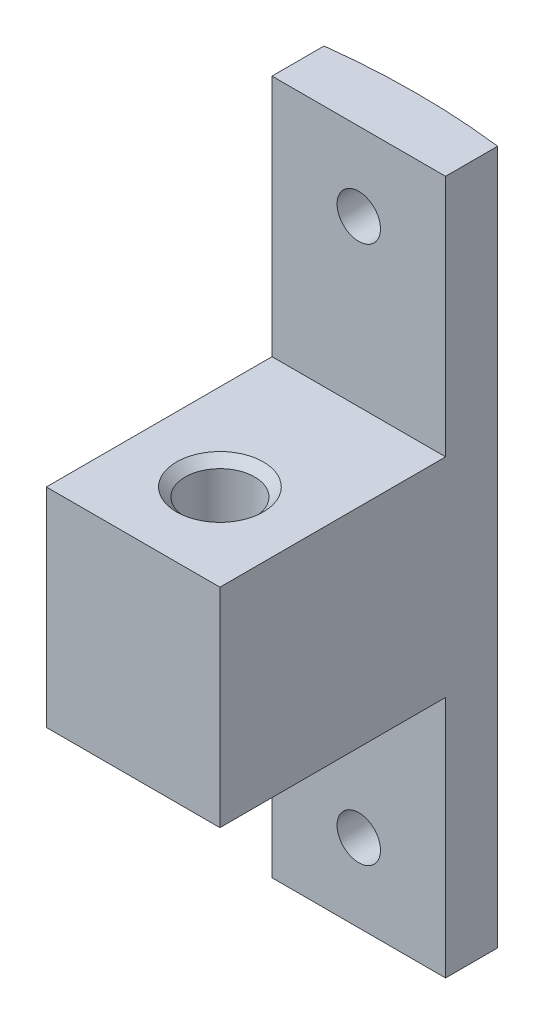
ISO-10303-21;
HEADER;
FILE_DESCRIPTION(('STEP AP214'),'2;1');
FILE_NAME('part.step','',(''),(''),'','','');
FILE_SCHEMA(('AUTOMOTIVE_DESIGN { 1 0 10303 214 1 1 1 1 }'));
ENDSEC;
DATA;
#1=APPLICATION_CONTEXT('core data for automotive mechanical design processes');
#2=APPLICATION_PROTOCOL_DEFINITION('international standard','automotive_design',2000,#1);
#3=PRODUCT_CONTEXT('',#1,'mechanical');
#4=PRODUCT('Part','Part','',(#3));
#5=PRODUCT_RELATED_PRODUCT_CATEGORY('part','',(#4));
#6=PRODUCT_DEFINITION_FORMATION('','',#4);
#7=PRODUCT_DEFINITION_CONTEXT('part definition',#1,'design');
#8=PRODUCT_DEFINITION('design','',#6,#7);
#9=PRODUCT_DEFINITION_SHAPE('','',#8);
#10=(LENGTH_UNIT() NAMED_UNIT(*) SI_UNIT(.MILLI.,.METRE.));
#11=(NAMED_UNIT(*) PLANE_ANGLE_UNIT() SI_UNIT($,.RADIAN.));
#12=(NAMED_UNIT(*) SI_UNIT($,.STERADIAN.) SOLID_ANGLE_UNIT());
#13=UNCERTAINTY_MEASURE_WITH_UNIT(LENGTH_MEASURE(1.E-05),#10,'distance_accuracy_value','');
#14=(GEOMETRIC_REPRESENTATION_CONTEXT(3) GLOBAL_UNCERTAINTY_ASSIGNED_CONTEXT((#13)) GLOBAL_UNIT_ASSIGNED_CONTEXT((#10,
#11,#12)) REPRESENTATION_CONTEXT('',''));
#15=CARTESIAN_POINT('',(0.,0.,0.));
#16=DIRECTION('',(0.,0.,1.));
#17=DIRECTION('',(1.,0.,0.));
#18=AXIS2_PLACEMENT_3D('',#15,#16,#17);
#19=CARTESIAN_POINT('',(0.,-20.,0.));
#20=DIRECTION('',(0.,0.,1.));
#21=DIRECTION('',(1.,0.,0.));
#22=AXIS2_PLACEMENT_3D('',#19,#20,#21);
#23=PLANE('',#22);
#24=CARTESIAN_POINT('',(5.,-15.5,0.));
#25=DIRECTION('',(0.,0.,1.));
#26=DIRECTION('',(1.,0.,0.));
#27=AXIS2_PLACEMENT_3D('',#24,#25,#26);
#28=CIRCLE('',#27,1.25);
#29=CARTESIAN_POINT('',(6.25,-15.5,0.));
#30=VERTEX_POINT('',#29);
#31=EDGE_CURVE('E225',#30,#30,#28,.T.);
#32=ORIENTED_EDGE('',*,*,#31,.F.);
#33=EDGE_LOOP('',(#32));
#34=FACE_BOUND('',#33,.T.);
#35=DIRECTION('',(0.,1.,0.));
#36=VECTOR('',#35,1.);
#37=CARTESIAN_POINT('',(10.,-20.,0.));
#38=LINE('',#37,#36);
#39=CARTESIAN_POINT('',(10.,-20.,0.));
#40=VERTEX_POINT('',#39);
#41=CARTESIAN_POINT('',(10.,-6.,0.));
#42=VERTEX_POINT('',#41);
#43=EDGE_CURVE('E126',#40,#42,#38,.T.);
#44=ORIENTED_EDGE('',*,*,#43,.T.);
#45=DIRECTION('',(1.,0.,0.));
#46=VECTOR('',#45,1.);
#47=CARTESIAN_POINT('',(10.,-6.,0.));
#48=LINE('',#47,#46);
#49=CARTESIAN_POINT('',(0.,-6.,0.));
#50=VERTEX_POINT('',#49);
#51=EDGE_CURVE('E115',#50,#42,#48,.T.);
#52=ORIENTED_EDGE('',*,*,#51,.F.);
#53=DIRECTION('',(0.,1.,0.));
#54=VECTOR('',#53,1.);
#55=CARTESIAN_POINT('',(0.,-20.,0.));
#56=LINE('',#55,#54);
#57=CARTESIAN_POINT('',(0.,-20.,0.));
#58=VERTEX_POINT('',#57);
#59=EDGE_CURVE('E136',#58,#50,#56,.T.);
#60=ORIENTED_EDGE('',*,*,#59,.F.);
#61=DIRECTION('',(1.,0.,0.));
#62=VECTOR('',#61,1.);
#63=CARTESIAN_POINT('',(0.,-20.,0.));
#64=LINE('',#63,#62);
#65=EDGE_CURVE('E134',#58,#40,#64,.T.);
#66=ORIENTED_EDGE('',*,*,#65,.T.);
#67=EDGE_LOOP('',(#44,#52,#60,#66));
#68=FACE_BOUND('',#67,.T.);
#69=ADVANCED_FACE('F45',(#34,#68),#23,.T.);
#70=CARTESIAN_POINT('',(0.,20.,-3.));
#71=DIRECTION('',(1.,0.,0.));
#72=DIRECTION('',(0.,0.,-1.));
#73=AXIS2_PLACEMENT_3D('',#70,#71,#72);
#74=PLANE('',#73);
#75=DIRECTION('',(0.,0.,-1.));
#76=VECTOR('',#75,1.);
#77=CARTESIAN_POINT('',(0.,-6.,0.));
#78=LINE('',#77,#76);
#79=CARTESIAN_POINT('',(0.,-6.,13.));
#80=VERTEX_POINT('',#79);
#81=EDGE_CURVE('E64',#80,#50,#78,.T.);
#82=ORIENTED_EDGE('',*,*,#81,.F.);
#83=DIRECTION('',(0.,-1.,0.));
#84=VECTOR('',#83,1.);
#85=CARTESIAN_POINT('',(0.,6.,13.));
#86=LINE('',#85,#84);
#87=CARTESIAN_POINT('',(0.,6.,13.));
#88=VERTEX_POINT('',#87);
#89=EDGE_CURVE('E157',#88,#80,#86,.T.);
#90=ORIENTED_EDGE('',*,*,#89,.F.);
#91=DIRECTION('',(0.,0.,-1.));
#92=VECTOR('',#91,1.);
#93=CARTESIAN_POINT('',(0.,6.,0.));
#94=LINE('',#93,#92);
#95=CARTESIAN_POINT('',(0.,6.,0.));
#96=VERTEX_POINT('',#95);
#97=EDGE_CURVE('E153',#88,#96,#94,.T.);
#98=ORIENTED_EDGE('',*,*,#97,.T.);
#99=DIRECTION('',(0.,-1.,0.));
#100=VECTOR('',#99,1.);
#101=CARTESIAN_POINT('',(0.,20.,0.));
#102=LINE('',#101,#100);
#103=CARTESIAN_POINT('',(0.,20.,0.));
#104=VERTEX_POINT('',#103);
#105=EDGE_CURVE('E176',#104,#96,#102,.T.);
#106=ORIENTED_EDGE('',*,*,#105,.F.);
#107=DIRECTION('',(0.,0.,1.));
#108=VECTOR('',#107,1.);
#109=CARTESIAN_POINT('',(0.,20.,-3.));
#110=LINE('',#109,#108);
#111=CARTESIAN_POINT('',(0.,20.,-3.));
#112=VERTEX_POINT('',#111);
#113=EDGE_CURVE('E159',#112,#104,#110,.T.);
#114=ORIENTED_EDGE('',*,*,#113,.F.);
#115=DIRECTION('',(0.,-1.,0.));
#116=VECTOR('',#115,1.);
#117=CARTESIAN_POINT('',(0.,20.,-3.));
#118=LINE('',#117,#116);
#119=CARTESIAN_POINT('',(0.,-20.,-3.));
#120=VERTEX_POINT('',#119);
#121=EDGE_CURVE('E169',#112,#120,#118,.T.);
#122=ORIENTED_EDGE('',*,*,#121,.T.);
#123=DIRECTION('',(0.,0.,1.));
#124=VECTOR('',#123,1.);
#125=CARTESIAN_POINT('',(0.,-20.,-3.));
#126=LINE('',#125,#124);
#127=EDGE_CURVE('E237',#120,#58,#126,.T.);
#128=ORIENTED_EDGE('',*,*,#127,.T.);
#129=ORIENTED_EDGE('',*,*,#59,.T.);
#130=EDGE_LOOP('',(#82,#90,#98,#106,#114,#122,#128,#129));
#131=FACE_BOUND('',#130,.T.);
#132=ADVANCED_FACE('F47',(#131),#74,.F.);
#133=CARTESIAN_POINT('',(0.,20.,0.));
#134=DIRECTION('',(0.,0.,-1.));
#135=DIRECTION('',(-1.,0.,0.));
#136=AXIS2_PLACEMENT_3D('',#133,#134,#135);
#137=PLANE('',#136);
#138=CARTESIAN_POINT('',(5.,15.5,0.));
#139=DIRECTION('',(0.,0.,-1.));
#140=DIRECTION('',(-1.,0.,0.));
#141=AXIS2_PLACEMENT_3D('',#138,#139,#140);
#142=CIRCLE('',#141,1.25);
#143=CARTESIAN_POINT('',(3.75,15.5,0.));
#144=VERTEX_POINT('',#143);
#145=EDGE_CURVE('E135',#144,#144,#142,.T.);
#146=ORIENTED_EDGE('',*,*,#145,.T.);
#147=EDGE_LOOP('',(#146));
#148=FACE_BOUND('',#147,.T.);
#149=ORIENTED_EDGE('',*,*,#105,.T.);
#150=DIRECTION('',(1.,0.,0.));
#151=VECTOR('',#150,1.);
#152=CARTESIAN_POINT('',(10.,6.,0.));
#153=LINE('',#152,#151);
#154=CARTESIAN_POINT('',(10.,6.,0.));
#155=VERTEX_POINT('',#154);
#156=EDGE_CURVE('E155',#96,#155,#153,.T.);
#157=ORIENTED_EDGE('',*,*,#156,.T.);
#158=DIRECTION('',(0.,-1.,0.));
#159=VECTOR('',#158,1.);
#160=CARTESIAN_POINT('',(10.,20.,0.));
#161=LINE('',#160,#159);
#162=CARTESIAN_POINT('',(10.,20.,0.));
#163=VERTEX_POINT('',#162);
#164=EDGE_CURVE('E173',#163,#155,#161,.T.);
#165=ORIENTED_EDGE('',*,*,#164,.F.);
#166=DIRECTION('',(1.,0.,0.));
#167=VECTOR('',#166,1.);
#168=CARTESIAN_POINT('',(0.,20.,0.));
#169=LINE('',#168,#167);
#170=EDGE_CURVE('E163',#104,#163,#169,.T.);
#171=ORIENTED_EDGE('',*,*,#170,.F.);
#172=EDGE_LOOP('',(#149,#157,#165,#171));
#173=FACE_BOUND('',#172,.T.);
#174=ADVANCED_FACE('F221',(#148,#173),#137,.F.);
#175=CARTESIAN_POINT('',(10.,20.,0.));
#176=DIRECTION('',(-1.,0.,0.));
#177=DIRECTION('',(0.,0.,1.));
#178=AXIS2_PLACEMENT_3D('',#175,#176,#177);
#179=PLANE('',#178);
#180=DIRECTION('',(0.,-1.,0.));
#181=VECTOR('',#180,1.);
#182=CARTESIAN_POINT('',(10.,6.,13.));
#183=LINE('',#182,#181);
#184=CARTESIAN_POINT('',(10.,6.,13.));
#185=VERTEX_POINT('',#184);
#186=CARTESIAN_POINT('',(10.,-6.,13.));
#187=VERTEX_POINT('',#186);
#188=EDGE_CURVE('E128',#185,#187,#183,.T.);
#189=ORIENTED_EDGE('',*,*,#188,.T.);
#190=DIRECTION('',(0.,0.,1.));
#191=VECTOR('',#190,1.);
#192=CARTESIAN_POINT('',(10.,-6.,0.));
#193=LINE('',#192,#191);
#194=EDGE_CURVE('E118',#42,#187,#193,.T.);
#195=ORIENTED_EDGE('',*,*,#194,.F.);
#196=ORIENTED_EDGE('',*,*,#43,.F.);
#197=DIRECTION('',(0.,0.,-1.));
#198=VECTOR('',#197,1.);
#199=CARTESIAN_POINT('',(10.,-20.,0.));
#200=LINE('',#199,#198);
#201=CARTESIAN_POINT('',(10.,-20.,-3.));
#202=VERTEX_POINT('',#201);
#203=EDGE_CURVE('E243',#40,#202,#200,.T.);
#204=ORIENTED_EDGE('',*,*,#203,.T.);
#205=DIRECTION('',(0.,-1.,0.));
#206=VECTOR('',#205,1.);
#207=CARTESIAN_POINT('',(10.,20.,-3.));
#208=LINE('',#207,#206);
#209=CARTESIAN_POINT('',(10.,20.,-3.));
#210=VERTEX_POINT('',#209);
#211=EDGE_CURVE('E171',#210,#202,#208,.T.);
#212=ORIENTED_EDGE('',*,*,#211,.F.);
#213=DIRECTION('',(0.,0.,-1.));
#214=VECTOR('',#213,1.);
#215=CARTESIAN_POINT('',(10.,20.,0.));
#216=LINE('',#215,#214);
#217=EDGE_CURVE('E165',#163,#210,#216,.T.);
#218=ORIENTED_EDGE('',*,*,#217,.F.);
#219=ORIENTED_EDGE('',*,*,#164,.T.);
#220=DIRECTION('',(0.,0.,1.));
#221=VECTOR('',#220,1.);
#222=CARTESIAN_POINT('',(10.,6.,0.));
#223=LINE('',#222,#221);
#224=EDGE_CURVE('E72',#155,#185,#223,.T.);
#225=ORIENTED_EDGE('',*,*,#224,.T.);
#226=EDGE_LOOP('',(#189,#195,#196,#204,#212,#218,#219,#225));
#227=FACE_BOUND('',#226,.T.);
#228=ADVANCED_FACE('F124',(#227),#179,.F.);
#229=CARTESIAN_POINT('',(5.00000000000001,20.,37.6939798987516));
#230=DIRECTION('',(0.,-1.,0.));
#231=DIRECTION('',(0.,0.,-1.));
#232=AXIS2_PLACEMENT_3D('',#229,#230,#231);
#233=CYLINDRICAL_SURFACE('',#232,41.);
#234=CARTESIAN_POINT('',(3.75,-15.5,-3.28696079323348));
#235=CARTESIAN_POINT('',(3.7500031075294,-15.5701955405805,-3.28696105037724));
#236=CARTESIAN_POINT('',(3.75593274424498,-15.6404415642771,-3.28714308569768));
#237=CARTESIAN_POINT('',(3.77950428422748,-15.7789977985344,-3.28785173285359));
#238=CARTESIAN_POINT('',(3.79716017439091,-15.8473055956283,-3.28837875617467));
#239=CARTESIAN_POINT('',(3.84368005366436,-15.9799580707946,-3.2897176230916));
#240=CARTESIAN_POINT('',(3.87253855542443,-16.0443046713203,-3.29052932722413));
#241=CARTESIAN_POINT('',(3.94063659140703,-16.167222076818,-3.29234591472407));
#242=CARTESIAN_POINT('',(3.9798735930476,-16.2257942860882,-3.29335075094669));
#243=CARTESIAN_POINT('',(4.06763625698283,-16.3355455919736,-3.29544092542842));
#244=CARTESIAN_POINT('',(4.11616558241317,-16.3867217589804,-3.29652629533109));
#245=CARTESIAN_POINT('',(4.22112890179022,-16.4802036192161,-3.29865492025522));
#246=CARTESIAN_POINT('',(4.27756321051765,-16.5225089590363,-3.29969817359744));
#247=CARTESIAN_POINT('',(4.39674556084645,-16.5970529689231,-3.30162512592686));
#248=CARTESIAN_POINT('',(4.45949471274696,-16.6292898646153,-3.30250879677908));
#249=CARTESIAN_POINT('',(4.58951761889159,-16.6827703540262,-3.30401672305851));
#250=CARTESIAN_POINT('',(4.65679135469989,-16.7040139925348,-3.30464097954265));
#251=CARTESIAN_POINT('',(4.79393148520832,-16.7348985934115,-3.30555953526519));
#252=CARTESIAN_POINT('',(4.86379706151894,-16.7445431866404,-3.30585393775614));
#253=CARTESIAN_POINT('',(5.00415617387375,-16.7519671081425,-3.30607994547648));
#254=CARTESIAN_POINT('',(5.07464970736679,-16.7497464845977,-3.3060115521791));
#255=CARTESIAN_POINT('',(5.21423908211133,-16.7335060736098,-3.30551976621976));
#256=CARTESIAN_POINT('',(5.28333537991781,-16.719490206278,-3.30509649150166));
#257=CARTESIAN_POINT('',(5.41819387894464,-16.6800632311266,-3.30394278229993));
#258=CARTESIAN_POINT('',(5.48395607271547,-16.6546520978474,-3.30321234713002));
#259=CARTESIAN_POINT('',(5.61029221681344,-16.5931514258188,-3.30152643690243));
#260=CARTESIAN_POINT('',(5.67086529226341,-16.5570600909554,-3.30057092399842));
#261=CARTESIAN_POINT('',(5.78509415101533,-16.4752248545007,-3.29854254070272));
#262=CARTESIAN_POINT('',(5.83874991789846,-16.4294809299987,-3.29746967003247));
#263=CARTESIAN_POINT('',(5.93764392339588,-16.329616827778,-3.29532696301871));
#264=CARTESIAN_POINT('',(5.98287872697371,-16.2754932482902,-3.29425712808799));
#265=CARTESIAN_POINT('',(6.06362030515631,-16.1604182084127,-3.29224154603573));
#266=CARTESIAN_POINT('',(6.09912707814584,-16.0994667468893,-3.2912957989348));
#267=CARTESIAN_POINT('',(6.15940430982788,-15.9724642068281,-3.28963506318744));
#268=CARTESIAN_POINT('',(6.18417465688095,-15.9064130752715,-3.28892007694053));
#269=CARTESIAN_POINT('',(6.22227368132276,-15.7710870321505,-3.2878015828926));
#270=CARTESIAN_POINT('',(6.23560239091644,-15.7018121296608,-3.28739807421485));
#271=CARTESIAN_POINT('',(6.25043557041324,-15.5620349010619,-3.28694819182452));
#272=CARTESIAN_POINT('',(6.25194479920421,-15.4915330804082,-3.28690167437641));
#273=CARTESIAN_POINT('',(6.24310857716121,-15.3512770691321,-3.28717064456275));
#274=CARTESIAN_POINT('',(6.23276314053332,-15.2815228776137,-3.28748613176339));
#275=CARTESIAN_POINT('',(6.20051519952208,-15.1447554825803,-3.28844341549814));
#276=CARTESIAN_POINT('',(6.17861485802616,-15.0777417686218,-3.28908515096313));
#277=CARTESIAN_POINT('',(6.12388097422322,-14.9483419400706,-3.29062253663916));
#278=CARTESIAN_POINT('',(6.09104740915378,-14.8859558351126,-3.29151818737884));
#279=CARTESIAN_POINT('',(6.01536684353063,-14.7675602264036,-3.29346278823371));
#280=CARTESIAN_POINT('',(5.97251663809948,-14.7115527720836,-3.29451178737321));
#281=CARTESIAN_POINT('',(5.87802385933089,-14.6075249015223,-3.29664465744102));
#282=CARTESIAN_POINT('',(5.82638126293008,-14.5595045062325,-3.29772852846078));
#283=CARTESIAN_POINT('',(5.71574926889708,-14.4727980009288,-3.29980937588143));
#284=CARTESIAN_POINT('',(5.65675746524779,-14.4341149600605,-3.30080632364244));
#285=CARTESIAN_POINT('',(5.53311390281868,-14.367202223466,-3.30260053491858));
#286=CARTESIAN_POINT('',(5.46846215700951,-14.3389725037851,-3.3033977988913));
#287=CARTESIAN_POINT('',(5.33534550604314,-14.2937731286034,-3.30470263360829));
#288=CARTESIAN_POINT('',(5.26688127645617,-14.2768014850158,-3.30521025549883));
#289=CARTESIAN_POINT('',(5.12807353296041,-14.2545935043519,-3.30587878720535));
#290=CARTESIAN_POINT('',(5.0577300208622,-14.2493571559696,-3.30603969735535));
#291=CARTESIAN_POINT('',(4.9171911971978,-14.2507686360955,-3.30599667011316));
#292=CARTESIAN_POINT('',(4.84699583697128,-14.2574116292588,-3.30579288116737));
#293=CARTESIAN_POINT('',(4.70871720856673,-14.2823832772388,-3.30504370946129));
#294=CARTESIAN_POINT('',(4.64063394456694,-14.300711955171,-3.30449832602528));
#295=CARTESIAN_POINT('',(4.50851032424643,-14.348534011607,-3.30312739499094));
#296=CARTESIAN_POINT('',(4.44447003503913,-14.3780275753912,-3.30230184274325));
#297=CARTESIAN_POINT('',(4.32225130952237,-14.4473405573608,-3.30046358986934));
#298=CARTESIAN_POINT('',(4.26407266191823,-14.4871596031584,-3.29945089599274));
#299=CARTESIAN_POINT('',(4.15520639610832,-14.576007594505,-3.29735204512127));
#300=CARTESIAN_POINT('',(4.10452103371875,-14.625039303433,-3.29626586614694));
#301=CARTESIAN_POINT('',(4.01208733953065,-14.7309302892472,-3.29414243418389));
#302=CARTESIAN_POINT('',(3.97034122353367,-14.7877915011335,-3.29310519337522));
#303=CARTESIAN_POINT('',(3.89696371115161,-14.9077500812149,-3.29119624281517));
#304=CARTESIAN_POINT('',(3.86533894901847,-14.9708515043658,-3.29032464178722));
#305=CARTESIAN_POINT('',(3.81316930721148,-15.1014221871699,-3.28884724230818));
#306=CARTESIAN_POINT('',(3.79261121735922,-15.1688861310379,-3.28824112711107));
#307=CARTESIAN_POINT('',(3.76860554155907,-15.2806467531374,-3.28752504034662));
#308=CARTESIAN_POINT('',(3.76163724492915,-15.3242180421844,-3.28731436720694));
#309=CARTESIAN_POINT('',(3.75233349907636,-15.4118529174667,-3.28703216292718));
#310=CARTESIAN_POINT('',(3.74999804844069,-15.455916503552,-3.28696063174465));
#311=CARTESIAN_POINT('',(3.75,-15.5,-3.28696079323348));
#312=B_SPLINE_CURVE_WITH_KNOTS('',3,(#234,#235,#236,#237,#238,#239,#240,#241,#242,#243,#244,
#245,#246,#247,#248,#249,#250,#251,#252,#253,#254,#255,#256,#257,#258,#259,#260,#261,#262,#263,
#264,#265,#266,#267,#268,#269,#270,#271,#272,#273,#274,#275,#276,#277,#278,#279,#280,#281,#282,
#283,#284,#285,#286,#287,#288,#289,#290,#291,#292,#293,#294,#295,#296,#297,#298,#299,#300,#301,
#302,#303,#304,#305,#306,#307,#308,#309,#310,#311),.UNSPECIFIED.,.T.,.F.,(4,2,2,2,2,2,2,2,2,2,2,
2,2,2,2,2,2,2,2,2,2,2,2,2,2,2,2,2,2,2,2,2,2,2,2,2,2,2,4),(0.,0.210425710972505,0.42110286638087,
0.631676956223839,0.842199708692116,1.05280562302946,1.26341992619409,1.47407132526019,
1.68472186606058,1.89530644953309,2.10589017787006,2.31640394700832,2.52691818648526,
2.73746784876488,2.94801801079288,3.15865387207249,3.36928976832598,3.57992785475961,
3.79056534830515,4.00111802833085,4.21167045604028,4.42218348578603,4.63269695381192,
4.84327786915818,5.05385933688915,5.264509927814,5.47516003601256,5.68577293516743,
5.8963856314151,6.10691261977959,6.31744002459026,6.52797092323981,6.73849423016172,
6.94908078558356,7.15971947954561,7.37049595958683,7.58102027672475,7.71316975280784,
7.84531918859133),.UNSPECIFIED.);
#313=CARTESIAN_POINT('',(3.75,-15.5,-3.28696079323348));
#314=VERTEX_POINT('',#313);
#315=EDGE_CURVE('E12',#314,#314,#312,.T.);
#316=ORIENTED_EDGE('',*,*,#315,.T.);
#317=EDGE_LOOP('',(#316));
#318=FACE_BOUND('',#317,.T.);
#319=CARTESIAN_POINT('',(3.75,15.5,-3.28696079323348));
#320=CARTESIAN_POINT('',(3.7500031075294,15.4298044594195,-3.28696105037723));
#321=CARTESIAN_POINT('',(3.75593274424498,15.3595584357229,-3.28714308569768));
#322=CARTESIAN_POINT('',(3.77950428422748,15.2210022014656,-3.28785173285359));
#323=CARTESIAN_POINT('',(3.79716017439091,15.1526944043717,-3.28837875617467));
#324=CARTESIAN_POINT('',(3.84368005366436,15.0200419292054,-3.2897176230916));
#325=CARTESIAN_POINT('',(3.87253855542442,14.9556953286797,-3.29052932722413));
#326=CARTESIAN_POINT('',(3.94063659140703,14.832777923182,-3.29234591472407));
#327=CARTESIAN_POINT('',(3.97987359304759,14.7742057139118,-3.29335075094669));
#328=CARTESIAN_POINT('',(4.06763625698283,14.6644544080264,-3.29544092542842));
#329=CARTESIAN_POINT('',(4.11616558241317,14.6132782410196,-3.2965262953311));
#330=CARTESIAN_POINT('',(4.22112890179021,14.5197963807839,-3.29865492025522));
#331=CARTESIAN_POINT('',(4.27756321051765,14.4774910409637,-3.29969817359744));
#332=CARTESIAN_POINT('',(4.39674556084644,14.4029470310769,-3.30162512592685));
#333=CARTESIAN_POINT('',(4.45949471274696,14.3707101353847,-3.30250879677908));
#334=CARTESIAN_POINT('',(4.58951761889159,14.3172296459738,-3.30401672305851));
#335=CARTESIAN_POINT('',(4.65679135469988,14.2959860074652,-3.30464097954265));
#336=CARTESIAN_POINT('',(4.79393148520832,14.2651014065885,-3.30555953526519));
#337=CARTESIAN_POINT('',(4.86379706151893,14.2554568133596,-3.30585393775614));
#338=CARTESIAN_POINT('',(5.00415617387375,14.2480328918575,-3.30607994547648));
#339=CARTESIAN_POINT('',(5.07464970736679,14.2502535154023,-3.3060115521791));
#340=CARTESIAN_POINT('',(5.21423908211132,14.2664939263902,-3.30551976621976));
#341=CARTESIAN_POINT('',(5.2833353799178,14.280509793722,-3.30509649150166));
#342=CARTESIAN_POINT('',(5.41819387894463,14.3199367688734,-3.30394278229993));
#343=CARTESIAN_POINT('',(5.48395607271547,14.3453479021526,-3.30321234713002));
#344=CARTESIAN_POINT('',(5.61029221681343,14.4068485741811,-3.30152643690243));
#345=CARTESIAN_POINT('',(5.6708652922634,14.4429399090445,-3.30057092399842));
#346=CARTESIAN_POINT('',(5.78509415101532,14.5247751454993,-3.29854254070272));
#347=CARTESIAN_POINT('',(5.83874991789846,14.5705190700013,-3.29746967003247));
#348=CARTESIAN_POINT('',(5.93764392339587,14.670383172222,-3.29532696301871));
#349=CARTESIAN_POINT('',(5.9828787269737,14.7245067517098,-3.29425712808799));
#350=CARTESIAN_POINT('',(6.06362030515631,14.8395817915872,-3.29224154603573));
#351=CARTESIAN_POINT('',(6.09912707814584,14.9005332531107,-3.2912957989348));
#352=CARTESIAN_POINT('',(6.15940430982788,15.0275357931719,-3.28963506318744));
#353=CARTESIAN_POINT('',(6.18417465688095,15.0935869247285,-3.28892007694053));
#354=CARTESIAN_POINT('',(6.22227368132276,15.2289129678495,-3.2878015828926));
#355=CARTESIAN_POINT('',(6.23560239091644,15.2981878703392,-3.28739807421485));
#356=CARTESIAN_POINT('',(6.25043557041324,15.4379650989381,-3.28694819182452));
#357=CARTESIAN_POINT('',(6.25194479920421,15.5084669195917,-3.28690167437641));
#358=CARTESIAN_POINT('',(6.24310857716121,15.6487229308679,-3.28717064456274));
#359=CARTESIAN_POINT('',(6.23276314053332,15.7184771223863,-3.28748613176338));
#360=CARTESIAN_POINT('',(6.20051519952208,15.8552445174196,-3.28844341549813));
#361=CARTESIAN_POINT('',(6.17861485802616,15.9222582313781,-3.28908515096313));
#362=CARTESIAN_POINT('',(6.12388097422322,16.0516580599294,-3.29062253663917));
#363=CARTESIAN_POINT('',(6.09104740915378,16.1140441648874,-3.29151818737884));
#364=CARTESIAN_POINT('',(6.01536684353063,16.2324397735964,-3.29346278823371));
#365=CARTESIAN_POINT('',(5.97251663809948,16.2884472279164,-3.29451178737321));
#366=CARTESIAN_POINT('',(5.8780238593309,16.3924750984777,-3.29664465744101));
#367=CARTESIAN_POINT('',(5.82638126293009,16.4404954937675,-3.29772852846078));
#368=CARTESIAN_POINT('',(5.71574926889709,16.5272019990712,-3.29980937588143));
#369=CARTESIAN_POINT('',(5.65675746524779,16.5658850399395,-3.30080632364244));
#370=CARTESIAN_POINT('',(5.53311390281868,16.632797776534,-3.30260053491858));
#371=CARTESIAN_POINT('',(5.46846215700951,16.6610274962149,-3.3033977988913));
#372=CARTESIAN_POINT('',(5.33534550604315,16.7062268713966,-3.30470263360829));
#373=CARTESIAN_POINT('',(5.26688127645618,16.7231985149842,-3.30521025549883));
#374=CARTESIAN_POINT('',(5.12807353296041,16.7454064956481,-3.30587878720535));
#375=CARTESIAN_POINT('',(5.05773002086221,16.7506428440304,-3.30603969735535));
#376=CARTESIAN_POINT('',(4.91719119719781,16.7492313639045,-3.30599667011316));
#377=CARTESIAN_POINT('',(4.84699583697129,16.7425883707412,-3.30579288116737));
#378=CARTESIAN_POINT('',(4.70871720856674,16.7176167227612,-3.30504370946129));
#379=CARTESIAN_POINT('',(4.64063394456695,16.699288044829,-3.30449832602528));
#380=CARTESIAN_POINT('',(4.50851032424643,16.651465988393,-3.30312739499094));
#381=CARTESIAN_POINT('',(4.44447003503914,16.6219724246088,-3.30230184274325));
#382=CARTESIAN_POINT('',(4.32225130952238,16.5526594426392,-3.30046358986934));
#383=CARTESIAN_POINT('',(4.26407266191823,16.5128403968416,-3.29945089599275));
#384=CARTESIAN_POINT('',(4.15520639610832,16.423992405495,-3.29735204512127));
#385=CARTESIAN_POINT('',(4.10452103371876,16.374960696567,-3.29626586614693));
#386=CARTESIAN_POINT('',(4.01208733953065,16.2690697107529,-3.29414243418389));
#387=CARTESIAN_POINT('',(3.97034122353367,16.2122084988666,-3.29310519337523));
#388=CARTESIAN_POINT('',(3.89696371115162,16.0922499187851,-3.29119624281518));
#389=CARTESIAN_POINT('',(3.86533894901847,16.0291484956342,-3.29032464178723));
#390=CARTESIAN_POINT('',(3.81316930721149,15.8985778128301,-3.28884724230818));
#391=CARTESIAN_POINT('',(3.79261121735922,15.8311138689622,-3.28824112711106));
#392=CARTESIAN_POINT('',(3.76860554155907,15.7193532468626,-3.28752504034662));
#393=CARTESIAN_POINT('',(3.76163724492915,15.6757819578156,-3.28731436720695));
#394=CARTESIAN_POINT('',(3.75233349907636,15.5881470825333,-3.28703216292718));
#395=CARTESIAN_POINT('',(3.74999804844069,15.544083496448,-3.28696063174466));
#396=CARTESIAN_POINT('',(3.75,15.5,-3.28696079323348));
#397=B_SPLINE_CURVE_WITH_KNOTS('',3,(#319,#320,#321,#322,#323,#324,#325,#326,#327,#328,#329,
#330,#331,#332,#333,#334,#335,#336,#337,#338,#339,#340,#341,#342,#343,#344,#345,#346,#347,#348,
#349,#350,#351,#352,#353,#354,#355,#356,#357,#358,#359,#360,#361,#362,#363,#364,#365,#366,#367,
#368,#369,#370,#371,#372,#373,#374,#375,#376,#377,#378,#379,#380,#381,#382,#383,#384,#385,#386,
#387,#388,#389,#390,#391,#392,#393,#394,#395,#396),.UNSPECIFIED.,.T.,.F.,(4,2,2,2,2,2,2,2,2,2,2,
2,2,2,2,2,2,2,2,2,2,2,2,2,2,2,2,2,2,2,2,2,2,2,2,2,2,2,4),(0.,0.210425710972503,
0.421102866380867,0.631676956223835,0.842199708692111,1.05280562302945,1.26341992619409,
1.47407132526019,1.68472186606058,1.89530644953309,2.10589017787006,2.31640394700832,
2.52691818648525,2.73746784876487,2.94801801079288,3.15865387207248,3.36928976832598,
3.5799278547596,3.79056534830514,4.00111802833084,4.21167045604028,4.42218348578603,
4.63269695381192,4.84327786915817,5.05385933688915,5.264509927814,5.47516003601255,
5.68577293516743,5.89638563141509,6.10691261977958,6.31744002459026,6.5279709232398,
6.73849423016171,6.94908078558356,7.1597194795456,7.37049595958682,7.58102027672475,
7.71316975280783,7.84531918859133),.UNSPECIFIED.);
#398=CARTESIAN_POINT('',(3.75,15.5,-3.28696079323348));
#399=VERTEX_POINT('',#398);
#400=EDGE_CURVE('E57',#399,#399,#397,.T.);
#401=ORIENTED_EDGE('',*,*,#400,.T.);
#402=EDGE_LOOP('',(#401));
#403=FACE_BOUND('',#402,.T.);
#404=ORIENTED_EDGE('',*,*,#211,.T.);
#405=CARTESIAN_POINT('',(5.00000000000001,-20.,37.6939798987516));
#406=DIRECTION('',(0.,1.,0.));
#407=DIRECTION('',(0.,0.,-1.));
#408=AXIS2_PLACEMENT_3D('',#405,#406,#407);
#409=CIRCLE('',#408,41.);
#410=EDGE_CURVE('E240',#202,#120,#409,.T.);
#411=ORIENTED_EDGE('',*,*,#410,.T.);
#412=ORIENTED_EDGE('',*,*,#121,.F.);
#413=CARTESIAN_POINT('',(5.00000000000001,20.,37.6939798987516));
#414=DIRECTION('',(0.,1.,0.));
#415=DIRECTION('',(0.,0.,-1.));
#416=AXIS2_PLACEMENT_3D('',#413,#414,#415);
#417=CIRCLE('',#416,41.);
#418=EDGE_CURVE('E167',#210,#112,#417,.T.);
#419=ORIENTED_EDGE('',*,*,#418,.F.);
#420=EDGE_LOOP('',(#404,#411,#412,#419));
#421=FACE_BOUND('',#420,.T.);
#422=ADVANCED_FACE('F182',(#318,#403,#421),#233,.T.);
#423=CARTESIAN_POINT('',(5.00000000000001,20.,37.6939798987516));
#424=DIRECTION('',(0.,-1.,0.));
#425=DIRECTION('',(0.,0.,-1.));
#426=AXIS2_PLACEMENT_3D('',#423,#424,#425);
#427=PLANE('',#426);
#428=ORIENTED_EDGE('',*,*,#113,.T.);
#429=ORIENTED_EDGE('',*,*,#170,.T.);
#430=ORIENTED_EDGE('',*,*,#217,.T.);
#431=ORIENTED_EDGE('',*,*,#418,.T.);
#432=EDGE_LOOP('',(#428,#429,#430,#431));
#433=FACE_BOUND('',#432,.T.);
#434=ADVANCED_FACE('F208',(#433),#427,.F.);
#435=CARTESIAN_POINT('',(10.,6.,13.));
#436=DIRECTION('',(0.,0.,1.));
#437=DIRECTION('',(1.,0.,0.));
#438=AXIS2_PLACEMENT_3D('',#435,#436,#437);
#439=PLANE('',#438);
#440=ORIENTED_EDGE('',*,*,#89,.T.);
#441=DIRECTION('',(-1.,0.,0.));
#442=VECTOR('',#441,1.);
#443=CARTESIAN_POINT('',(10.,-6.,13.));
#444=LINE('',#443,#442);
#445=EDGE_CURVE('E235',#187,#80,#444,.T.);
#446=ORIENTED_EDGE('',*,*,#445,.F.);
#447=ORIENTED_EDGE('',*,*,#188,.F.);
#448=DIRECTION('',(-1.,0.,0.));
#449=VECTOR('',#448,1.);
#450=CARTESIAN_POINT('',(10.,6.,13.));
#451=LINE('',#450,#449);
#452=EDGE_CURVE('E150',#185,#88,#451,.T.);
#453=ORIENTED_EDGE('',*,*,#452,.T.);
#454=EDGE_LOOP('',(#440,#446,#447,#453));
#455=FACE_BOUND('',#454,.T.);
#456=ADVANCED_FACE('F205',(#455),#439,.T.);
#457=CARTESIAN_POINT('',(0.,6.,0.));
#458=DIRECTION('',(0.,-1.,0.));
#459=DIRECTION('',(0.,0.,-1.));
#460=AXIS2_PLACEMENT_3D('',#457,#458,#459);
#461=PLANE('',#460);
#462=CARTESIAN_POINT('',(5.,6.,8.));
#463=DIRECTION('',(0.,1.,0.));
#464=DIRECTION('',(0.,0.,1.));
#465=AXIS2_PLACEMENT_3D('',#462,#463,#464);
#466=CIRCLE('',#465,2.5);
#467=CARTESIAN_POINT('',(5.,6.,10.5));
#468=VERTEX_POINT('',#467);
#469=EDGE_CURVE('E139',#468,#468,#466,.T.);
#470=ORIENTED_EDGE('',*,*,#469,.F.);
#471=EDGE_LOOP('',(#470));
#472=FACE_BOUND('',#471,.T.);
#473=ORIENTED_EDGE('',*,*,#224,.F.);
#474=ORIENTED_EDGE('',*,*,#156,.F.);
#475=ORIENTED_EDGE('',*,*,#97,.F.);
#476=ORIENTED_EDGE('',*,*,#452,.F.);
#477=EDGE_LOOP('',(#473,#474,#475,#476));
#478=FACE_BOUND('',#477,.T.);
#479=ADVANCED_FACE('F201',(#472,#478),#461,.F.);
#480=CARTESIAN_POINT('',(5.,6.,8.));
#481=DIRECTION('',(0.,1.,0.));
#482=DIRECTION('',(0.,0.,1.));
#483=AXIS2_PLACEMENT_3D('',#480,#481,#482);
#484=CYLINDRICAL_SURFACE('',#483,2.);
#485=CARTESIAN_POINT('',(5.,5.5,8.));
#486=DIRECTION('',(0.,1.,0.));
#487=DIRECTION('',(0.,0.,1.));
#488=AXIS2_PLACEMENT_3D('',#485,#486,#487);
#489=CIRCLE('',#488,2.);
#490=CARTESIAN_POINT('',(5.,5.5,10.));
#491=VERTEX_POINT('',#490);
#492=EDGE_CURVE('E146',#491,#491,#489,.T.);
#493=ORIENTED_EDGE('',*,*,#492,.T.);
#494=EDGE_LOOP('',(#493));
#495=FACE_BOUND('',#494,.T.);
#496=CARTESIAN_POINT('',(5.,-5.5,8.));
#497=DIRECTION('',(0.,-1.,0.));
#498=DIRECTION('',(0.,0.,-1.));
#499=AXIS2_PLACEMENT_3D('',#496,#497,#498);
#500=CIRCLE('',#499,2.);
#501=CARTESIAN_POINT('',(5.,-5.5,6.));
#502=VERTEX_POINT('',#501);
#503=EDGE_CURVE('E130',#502,#502,#500,.T.);
#504=ORIENTED_EDGE('',*,*,#503,.T.);
#505=EDGE_LOOP('',(#504));
#506=FACE_BOUND('',#505,.T.);
#507=ADVANCED_FACE('F197',(#495,#506),#484,.F.);
#508=CARTESIAN_POINT('',(5.,6.,8.));
#509=DIRECTION('',(0.,1.,0.));
#510=DIRECTION('',(0.,0.,1.));
#511=AXIS2_PLACEMENT_3D('',#508,#509,#510);
#512=CONICAL_SURFACE('',#511,2.5,0.785398163397449);
#513=ORIENTED_EDGE('',*,*,#492,.F.);
#514=EDGE_LOOP('',(#513));
#515=FACE_BOUND('',#514,.T.);
#516=ORIENTED_EDGE('',*,*,#469,.T.);
#517=EDGE_LOOP('',(#516));
#518=FACE_BOUND('',#517,.T.);
#519=ADVANCED_FACE('F192',(#515,#518),#512,.F.);
#520=CARTESIAN_POINT('',(5.,15.5,-3.30602010124838));
#521=DIRECTION('',(0.,0.,-1.));
#522=DIRECTION('',(-1.,0.,0.));
#523=AXIS2_PLACEMENT_3D('',#520,#521,#522);
#524=CYLINDRICAL_SURFACE('',#523,1.25);
#525=ORIENTED_EDGE('',*,*,#400,.F.);
#526=EDGE_LOOP('',(#525));
#527=FACE_BOUND('',#526,.T.);
#528=ORIENTED_EDGE('',*,*,#145,.F.);
#529=EDGE_LOOP('',(#528));
#530=FACE_BOUND('',#529,.T.);
#531=ADVANCED_FACE('F186',(#527,#530),#524,.F.);
#532=CARTESIAN_POINT('',(5.00000000000001,-20.,37.6939798987516));
#533=DIRECTION('',(0.,1.,0.));
#534=DIRECTION('',(0.,0.,-1.));
#535=AXIS2_PLACEMENT_3D('',#532,#533,#534);
#536=PLANE('',#535);
#537=ORIENTED_EDGE('',*,*,#127,.F.);
#538=ORIENTED_EDGE('',*,*,#410,.F.);
#539=ORIENTED_EDGE('',*,*,#203,.F.);
#540=ORIENTED_EDGE('',*,*,#65,.F.);
#541=EDGE_LOOP('',(#537,#538,#539,#540));
#542=FACE_BOUND('',#541,.T.);
#543=ADVANCED_FACE('F191',(#542),#536,.F.);
#544=CARTESIAN_POINT('',(0.,-6.,0.));
#545=DIRECTION('',(0.,1.,0.));
#546=DIRECTION('',(0.,0.,-1.));
#547=AXIS2_PLACEMENT_3D('',#544,#545,#546);
#548=PLANE('',#547);
#549=CARTESIAN_POINT('',(5.,-6.,8.));
#550=DIRECTION('',(0.,-1.,0.));
#551=DIRECTION('',(0.,0.,-1.));
#552=AXIS2_PLACEMENT_3D('',#549,#550,#551);
#553=CIRCLE('',#552,2.5);
#554=CARTESIAN_POINT('',(5.,-6.,5.5));
#555=VERTEX_POINT('',#554);
#556=EDGE_CURVE('E227',#555,#555,#553,.T.);
#557=ORIENTED_EDGE('',*,*,#556,.F.);
#558=EDGE_LOOP('',(#557));
#559=FACE_BOUND('',#558,.T.);
#560=ORIENTED_EDGE('',*,*,#194,.T.);
#561=ORIENTED_EDGE('',*,*,#445,.T.);
#562=ORIENTED_EDGE('',*,*,#81,.T.);
#563=ORIENTED_EDGE('',*,*,#51,.T.);
#564=EDGE_LOOP('',(#560,#561,#562,#563));
#565=FACE_BOUND('',#564,.T.);
#566=ADVANCED_FACE('F117',(#559,#565),#548,.F.);
#567=CARTESIAN_POINT('',(5.,-6.,8.));
#568=DIRECTION('',(0.,-1.,0.));
#569=DIRECTION('',(0.,0.,-1.));
#570=AXIS2_PLACEMENT_3D('',#567,#568,#569);
#571=CONICAL_SURFACE('',#570,2.5,0.785398163397449);
#572=ORIENTED_EDGE('',*,*,#503,.F.);
#573=EDGE_LOOP('',(#572));
#574=FACE_BOUND('',#573,.T.);
#575=ORIENTED_EDGE('',*,*,#556,.T.);
#576=EDGE_LOOP('',(#575));
#577=FACE_BOUND('',#576,.T.);
#578=ADVANCED_FACE('F305',(#574,#577),#571,.F.);
#579=CARTESIAN_POINT('',(5.,-15.5,-3.30602010124838));
#580=DIRECTION('',(0.,0.,-1.));
#581=DIRECTION('',(-1.,0.,0.));
#582=AXIS2_PLACEMENT_3D('',#579,#580,#581);
#583=CYLINDRICAL_SURFACE('',#582,1.25);
#584=ORIENTED_EDGE('',*,*,#31,.T.);
#585=EDGE_LOOP('',(#584));
#586=FACE_BOUND('',#585,.T.);
#587=ORIENTED_EDGE('',*,*,#315,.F.);
#588=EDGE_LOOP('',(#587));
#589=FACE_BOUND('',#588,.T.);
#590=ADVANCED_FACE('F314',(#586,#589),#583,.F.);
#591=CLOSED_SHELL('',(#69,#132,#174,#228,#422,#434,#456,#479,#507,#519,#531,#543,#566,#578,#590));
#592=MANIFOLD_SOLID_BREP('B2',#591);
#593=ADVANCED_BREP_SHAPE_REPRESENTATION('',(#18,#592),#14);
#594=SHAPE_DEFINITION_REPRESENTATION(#9,#593);
ENDSEC;
END-ISO-10303-21;
